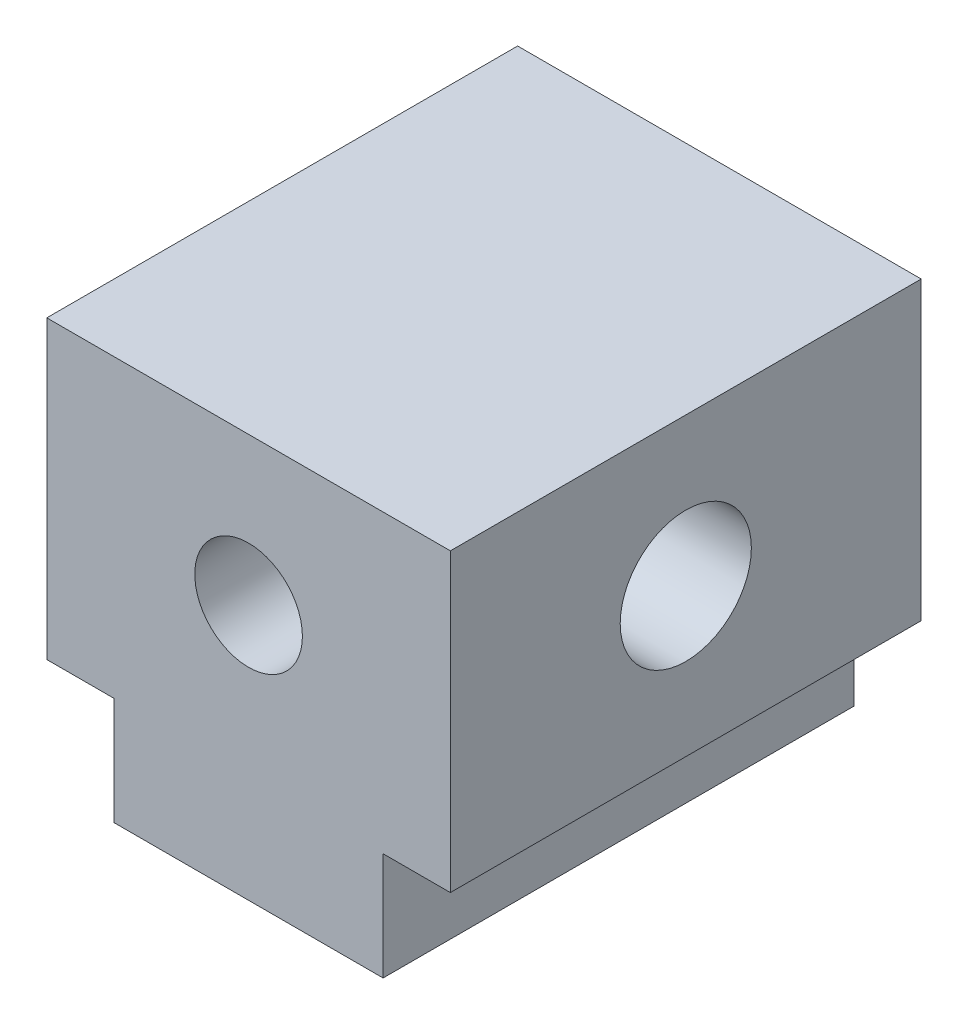
ISO-10303-21;
HEADER;
FILE_DESCRIPTION(('STEP AP214'),'2;1');
FILE_NAME('part.step','',(''),(''),'','','');
FILE_SCHEMA(('AUTOMOTIVE_DESIGN { 1 0 10303 214 1 1 1 1 }'));
ENDSEC;
DATA;
#1=APPLICATION_CONTEXT('core data for automotive mechanical design processes');
#2=APPLICATION_PROTOCOL_DEFINITION('international standard','automotive_design',2000,#1);
#3=PRODUCT_CONTEXT('',#1,'mechanical');
#4=PRODUCT('Part','Part','',(#3));
#5=PRODUCT_RELATED_PRODUCT_CATEGORY('part','',(#4));
#6=PRODUCT_DEFINITION_FORMATION('','',#4);
#7=PRODUCT_DEFINITION_CONTEXT('part definition',#1,'design');
#8=PRODUCT_DEFINITION('design','',#6,#7);
#9=PRODUCT_DEFINITION_SHAPE('','',#8);
#10=(LENGTH_UNIT() NAMED_UNIT(*) SI_UNIT(.MILLI.,.METRE.));
#11=(NAMED_UNIT(*) PLANE_ANGLE_UNIT() SI_UNIT($,.RADIAN.));
#12=(NAMED_UNIT(*) SI_UNIT($,.STERADIAN.) SOLID_ANGLE_UNIT());
#13=UNCERTAINTY_MEASURE_WITH_UNIT(LENGTH_MEASURE(1.E-05),#10,'distance_accuracy_value','');
#14=(GEOMETRIC_REPRESENTATION_CONTEXT(3) GLOBAL_UNCERTAINTY_ASSIGNED_CONTEXT((#13)) GLOBAL_UNIT_ASSIGNED_CONTEXT((#10,
#11,#12)) REPRESENTATION_CONTEXT('',''));
#15=CARTESIAN_POINT('',(0.,0.,0.));
#16=DIRECTION('',(0.,0.,1.));
#17=DIRECTION('',(1.,0.,0.));
#18=AXIS2_PLACEMENT_3D('',#15,#16,#17);
#19=CARTESIAN_POINT('',(0.,3.8,-3.501));
#20=DIRECTION('',(0.,0.,1.));
#21=DIRECTION('',(1.,0.,0.));
#22=AXIS2_PLACEMENT_3D('',#19,#20,#21);
#23=CYLINDRICAL_SURFACE('',#22,0.8);
#24=CARTESIAN_POINT('',(0.8,3.8,-0.975));
#25=CARTESIAN_POINT('',(0.79999675378019,3.83813522650326,-0.974996835684643));
#26=CARTESIAN_POINT('',(0.797250701604247,3.87631607682697,-0.972740254379695));
#27=CARTESIAN_POINT('',(0.786456623715734,3.95143626600888,-0.963913791725579));
#28=CARTESIAN_POINT('',(0.778398753182734,3.98837316548692,-0.957335901424593));
#29=CARTESIAN_POINT('',(0.757575286272899,4.05971588671167,-0.940482912094043));
#30=CARTESIAN_POINT('',(0.744839617977395,4.09413616656669,-0.930231326934823));
#31=CARTESIAN_POINT('',(0.715307168878112,4.16005903466576,-0.906757687563252));
#32=CARTESIAN_POINT('',(0.698509974464046,4.19156132530076,-0.893535330828602));
#33=CARTESIAN_POINT('',(0.654774225304942,4.26212655074264,-0.859707001268203));
#34=CARTESIAN_POINT('',(0.626362344325594,4.29982362032105,-0.838157251538843));
#35=CARTESIAN_POINT('',(0.564214865219415,4.36906643621973,-0.792785443210562));
#36=CARTESIAN_POINT('',(0.530464125561202,4.40059409865207,-0.76895700041883));
#37=CARTESIAN_POINT('',(0.457608635794029,4.45786250220208,-0.720602432408092));
#38=CARTESIAN_POINT('',(0.418420804702678,4.48349277558161,-0.696071386235007));
#39=CARTESIAN_POINT('',(0.335099143615724,4.52796311027631,-0.649399668387679));
#40=CARTESIAN_POINT('',(0.290981291369387,4.54682431794605,-0.62725170656325));
#41=CARTESIAN_POINT('',(0.218161420313733,4.57016320390681,-0.598045361603958));
#42=CARTESIAN_POINT('',(0.191270016242333,4.57731307879045,-0.588645322557748));
#43=CARTESIAN_POINT('',(0.136019304792788,4.58885476415115,-0.573085406868067));
#44=CARTESIAN_POINT('',(0.107663845856726,4.59325344313027,-0.566917467423065));
#45=CARTESIAN_POINT('',(0.0496956827260018,4.5989896304707,-0.558809880083556));
#46=CARTESIAN_POINT('',(0.0200727428057121,4.60029373672876,-0.556916380031102));
#47=CARTESIAN_POINT('',(-0.0390564443748505,4.5995936405355,-0.557920101079986));
#48=CARTESIAN_POINT('',(-0.0685626378581383,4.5975880591109,-0.560819319056451));
#49=CARTESIAN_POINT('',(-0.129767772416907,4.59007590671847,-0.571356918283067));
#50=CARTESIAN_POINT('',(-0.16132814469529,4.58419290501566,-0.579502417660072));
#51=CARTESIAN_POINT('',(-0.222476569919387,4.56909199264604,-0.599397929076108));
#52=CARTESIAN_POINT('',(-0.252058010456078,4.55986350417003,-0.61115935588377));
#53=CARTESIAN_POINT('',(-0.324932725291099,4.53257390802003,-0.643914726395867));
#54=CARTESIAN_POINT('',(-0.36676301032691,4.51245047068432,-0.666417628397463));
#55=CARTESIAN_POINT('',(-0.445772150055578,4.46587699922014,-0.712971156308936));
#56=CARTESIAN_POINT('',(-0.482943091123136,4.43941641781352,-0.737024313094684));
#57=CARTESIAN_POINT('',(-0.553985770683789,4.37909982747328,-0.785381905826078));
#58=CARTESIAN_POINT('',(-0.587661160701332,4.34498624428276,-0.809656590655655));
#59=CARTESIAN_POINT('',(-0.649069029951085,4.27014846792406,-0.855276304492544));
#60=CARTESIAN_POINT('',(-0.676815813384127,4.22944061242037,-0.876628339278555));
#61=CARTESIAN_POINT('',(-0.718561299582658,4.15356749581979,-0.909305542959162));
#62=CARTESIAN_POINT('',(-0.734252194569319,4.11983195257097,-0.921785073334877));
#63=CARTESIAN_POINT('',(-0.761020368817385,4.04951852440013,-0.943245768081007));
#64=CARTESIAN_POINT('',(-0.772100889028747,4.012942657673,-0.952229389677891));
#65=CARTESIAN_POINT('',(-0.789037108575718,3.93755441218489,-0.966012473438505));
#66=CARTESIAN_POINT('',(-0.794858078201296,3.89872894307677,-0.970784118502424));
#67=CARTESIAN_POINT('',(-0.800704248928243,3.82035448297525,-0.975576367136624));
#68=CARTESIAN_POINT('',(-0.800731971727789,3.78080581427516,-0.975599037851699));
#69=CARTESIAN_POINT('',(-0.795299606155112,3.70650389397399,-0.971146107746782));
#70=CARTESIAN_POINT('',(-0.790407437574687,3.67167811322787,-0.967136022318082));
#71=CARTESIAN_POINT('',(-0.776279628166083,3.60352712348421,-0.955624587323457));
#72=CARTESIAN_POINT('',(-0.767043212712076,3.57020218326432,-0.94812261511913));
#73=CARTESIAN_POINT('',(-0.744315275944544,3.50463405077271,-0.929829572303148));
#74=CARTESIAN_POINT('',(-0.730687875297833,3.47246791095862,-0.918933901996815));
#75=CARTESIAN_POINT('',(-0.699870723536614,3.41094148321845,-0.894625555272722));
#76=CARTESIAN_POINT('',(-0.682679920908722,3.38158202725322,-0.881212136010745));
#77=CARTESIAN_POINT('',(-0.636772104130254,3.31327851603956,-0.846046245599281));
#78=CARTESIAN_POINT('',(-0.606357424126155,3.27600061143419,-0.823264968404886));
#79=CARTESIAN_POINT('',(-0.540082393800863,3.20790091131542,-0.775742295350261));
#80=CARTESIAN_POINT('',(-0.504201414092135,3.17710467240532,-0.75099365154501));
#81=CARTESIAN_POINT('',(-0.426850860018546,3.12168720590458,-0.701369130728367));
#82=CARTESIAN_POINT('',(-0.385296293367918,3.09718044238039,-0.676498301479591));
#83=CARTESIAN_POINT('',(-0.296886290088613,3.05553690454922,-0.630357868519232));
#84=CARTESIAN_POINT('',(-0.250060246482033,3.03836159532296,-0.609069800722386));
#85=CARTESIAN_POINT('',(-0.174719889137956,3.01885925598321,-0.583584395880664));
#86=CARTESIAN_POINT('',(-0.148168289177712,3.01336003061554,-0.576083739341004));
#87=CARTESIAN_POINT('',(-0.0939349122873552,3.00506289122422,-0.564580077726652));
#88=CARTESIAN_POINT('',(-0.0662562092012478,3.00225808398754,-0.560568149838496));
#89=CARTESIAN_POINT('',(-0.0102690743506266,2.99957299751458,-0.556730435753923));
#90=CARTESIAN_POINT('',(0.0180422770977283,2.99971180100574,-0.556931964273182));
#91=CARTESIAN_POINT('',(0.0741627798115741,3.00294720986337,-0.561549935443922));
#92=CARTESIAN_POINT('',(0.101971107715643,3.00604828364187,-0.565972745644235));
#93=CARTESIAN_POINT('',(0.163453658863582,3.0161043390223,-0.579845955370775));
#94=CARTESIAN_POINT('',(0.196759994092443,3.02385511662736,-0.590308697731782));
#95=CARTESIAN_POINT('',(0.260980780257925,3.04301950696168,-0.614691957527655));
#96=CARTESIAN_POINT('',(0.291887352225557,3.05444460023147,-0.628623281454652));
#97=CARTESIAN_POINT('',(0.366959447457161,3.08740078165481,-0.666130982109441));
#98=CARTESIAN_POINT('',(0.409562903591044,3.11108804270886,-0.690930049676412));
#99=CARTESIAN_POINT('',(0.489602830672881,3.165469107549,-0.741200898898482));
#100=CARTESIAN_POINT('',(0.527032187382607,3.19617240737921,-0.766673550531718));
#101=CARTESIAN_POINT('',(0.597076400177648,3.2652403701182,-0.816399414187212));
#102=CARTESIAN_POINT('',(0.629574814985298,3.30375121232134,-0.840616203376616));
#103=CARTESIAN_POINT('',(0.687521966500875,3.38781267318771,-0.884852982938632));
#104=CARTESIAN_POINT('',(0.712991961276728,3.43334139977748,-0.904885583059464));
#105=CARTESIAN_POINT('',(0.748196692318942,3.51456613899067,-0.932926479586346));
#106=CARTESIAN_POINT('',(0.760353144907861,3.54860411889297,-0.942724386882504));
#107=CARTESIAN_POINT('',(0.78004825938306,3.61877185233386,-0.958679434124356));
#108=CARTESIAN_POINT('',(0.787598015950142,3.65489634898366,-0.964845320111216));
#109=CARTESIAN_POINT('',(0.795065707262808,3.7094542564849,-0.970954629311222));
#110=CARTESIAN_POINT('',(0.796912007444435,3.72747491621141,-0.97246759980646));
#111=CARTESIAN_POINT('',(0.79938008539513,3.76366023894891,-0.97449116854848));
#112=CARTESIAN_POINT('',(0.800001547132455,3.78182493791125,-0.975001508097193));
#113=CARTESIAN_POINT('',(0.8,3.8,-0.975));
#114=B_SPLINE_CURVE_WITH_KNOTS('',3,(#24,#25,#26,#27,#28,#29,#30,#31,#32,#33,#34,#35,#36,#37,
#38,#39,#40,#41,#42,#43,#44,#45,#46,#47,#48,#49,#50,#51,#52,#53,#54,#55,#56,#57,#58,#59,#60,#61,
#62,#63,#64,#65,#66,#67,#68,#69,#70,#71,#72,#73,#74,#75,#76,#77,#78,#79,#80,#81,#82,#83,#84,#85,
#86,#87,#88,#89,#90,#91,#92,#93,#94,#95,#96,#97,#98,#99,#100,#101,#102,#103,#104,#105,#106,#107,
#108,#109,#110,#111,#112,#113),.UNSPECIFIED.,.T.,.F.,(4,2,2,2,2,2,2,2,2,2,2,2,2,2,2,2,2,2,2,2,2,
2,2,2,2,2,2,2,2,2,2,2,2,2,2,2,2,2,2,2,2,2,2,2,4),(0.,0.11432670953963,0.228865907962485,
0.342684710002764,0.456515107799814,0.61136206472006,0.766656327897404,0.924657898727377,
1.08216149042491,1.17001262710475,1.25764355416348,1.34621613038743,1.4348256194769,
1.5336351336946,1.63275982975433,1.78669715802016,1.94089249577837,2.10137571012462,
2.26146723466342,2.37873959773409,2.49592938213153,2.61388745252117,2.73179417773601,
2.83749264648885,2.94320996956206,3.05257663920771,3.16197562758952,3.32082383116902,
3.48028708708496,3.64247421364954,3.80379804438979,3.88790724118201,3.97180068120542,
4.05623814770604,4.14080318466629,4.24748415772695,4.35450175197632,4.51772806714589,
4.68117662775412,4.84802764319906,5.01436832943688,5.12627402303128,5.2379091301729,
5.29238262637357,5.346870175939),.UNSPECIFIED.);
#115=CARTESIAN_POINT('',(0.8,3.8,-0.975));
#116=VERTEX_POINT('',#115);
#117=EDGE_CURVE('E152',#116,#116,#114,.T.);
#118=ORIENTED_EDGE('',*,*,#117,.T.);
#119=EDGE_LOOP('',(#118));
#120=FACE_BOUND('',#119,.T.);
#121=CARTESIAN_POINT('',(0.,3.8,-3.5));
#122=DIRECTION('',(0.,0.,1.));
#123=DIRECTION('',(1.,0.,0.));
#124=AXIS2_PLACEMENT_3D('',#121,#122,#123);
#125=CIRCLE('',#124,0.8);
#126=CARTESIAN_POINT('',(0.8,3.8,-3.5));
#127=VERTEX_POINT('',#126);
#128=EDGE_CURVE('E219',#127,#127,#125,.F.);
#129=ORIENTED_EDGE('',*,*,#128,.T.);
#130=EDGE_LOOP('',(#129));
#131=FACE_BOUND('',#130,.T.);
#132=ADVANCED_FACE('F34',(#120,#131),#23,.F.);
#133=CARTESIAN_POINT('',(-2.,6.,3.5));
#134=DIRECTION('',(1.,0.,0.));
#135=DIRECTION('',(0.,0.,-1.));
#136=AXIS2_PLACEMENT_3D('',#133,#134,#135);
#137=PLANE('',#136);
#138=DIRECTION('',(0.,0.,1.));
#139=VECTOR('',#138,1.);
#140=CARTESIAN_POINT('',(-2.,1.6,-8.01220566907139));
#141=LINE('',#140,#139);
#142=CARTESIAN_POINT('',(-2.,1.6,-3.5));
#143=VERTEX_POINT('',#142);
#144=CARTESIAN_POINT('',(-2.,1.6,3.5));
#145=VERTEX_POINT('',#144);
#146=EDGE_CURVE('E51',#143,#145,#141,.T.);
#147=ORIENTED_EDGE('',*,*,#146,.F.);
#148=DIRECTION('',(0.,-1.,0.));
#149=VECTOR('',#148,1.);
#150=CARTESIAN_POINT('',(-2.,6.,-3.5));
#151=LINE('',#150,#149);
#152=CARTESIAN_POINT('',(-2.,0.,-3.5));
#153=VERTEX_POINT('',#152);
#154=EDGE_CURVE('E43',#143,#153,#151,.T.);
#155=ORIENTED_EDGE('',*,*,#154,.T.);
#156=DIRECTION('',(0.,0.,1.));
#157=VECTOR('',#156,1.);
#158=CARTESIAN_POINT('',(-2.,0.,3.5));
#159=LINE('',#158,#157);
#160=CARTESIAN_POINT('',(-2.,0.,3.5));
#161=VERTEX_POINT('',#160);
#162=EDGE_CURVE('E185',#153,#161,#159,.T.);
#163=ORIENTED_EDGE('',*,*,#162,.T.);
#164=DIRECTION('',(0.,-1.,0.));
#165=VECTOR('',#164,1.);
#166=CARTESIAN_POINT('',(-2.,6.,3.5));
#167=LINE('',#166,#165);
#168=EDGE_CURVE('E178',#145,#161,#167,.T.);
#169=ORIENTED_EDGE('',*,*,#168,.F.);
#170=EDGE_LOOP('',(#147,#155,#163,#169));
#171=FACE_BOUND('',#170,.T.);
#172=ADVANCED_FACE('F186',(#171),#137,.F.);
#173=CARTESIAN_POINT('',(2.,6.,3.5));
#174=DIRECTION('',(-1.,0.,0.));
#175=DIRECTION('',(0.,0.,1.));
#176=AXIS2_PLACEMENT_3D('',#173,#174,#175);
#177=PLANE('',#176);
#178=DIRECTION('',(0.,-1.,0.));
#179=VECTOR('',#178,1.);
#180=CARTESIAN_POINT('',(2.,6.,-3.5));
#181=LINE('',#180,#179);
#182=CARTESIAN_POINT('',(2.,1.6,-3.5));
#183=VERTEX_POINT('',#182);
#184=CARTESIAN_POINT('',(2.,0.,-3.5));
#185=VERTEX_POINT('',#184);
#186=EDGE_CURVE('E12',#183,#185,#181,.T.);
#187=ORIENTED_EDGE('',*,*,#186,.F.);
#188=DIRECTION('',(0.,0.,1.));
#189=VECTOR('',#188,1.);
#190=CARTESIAN_POINT('',(2.,1.6,-8.01220566907139));
#191=LINE('',#190,#189);
#192=CARTESIAN_POINT('',(2.,1.6,3.5));
#193=VERTEX_POINT('',#192);
#194=EDGE_CURVE('E206',#183,#193,#191,.T.);
#195=ORIENTED_EDGE('',*,*,#194,.T.);
#196=DIRECTION('',(0.,-1.,0.));
#197=VECTOR('',#196,1.);
#198=CARTESIAN_POINT('',(2.,6.,3.5));
#199=LINE('',#198,#197);
#200=CARTESIAN_POINT('',(2.,0.,3.5));
#201=VERTEX_POINT('',#200);
#202=EDGE_CURVE('E138',#193,#201,#199,.T.);
#203=ORIENTED_EDGE('',*,*,#202,.T.);
#204=DIRECTION('',(0.,0.,-1.));
#205=VECTOR('',#204,1.);
#206=CARTESIAN_POINT('',(2.,0.,3.5));
#207=LINE('',#206,#205);
#208=EDGE_CURVE('E193',#201,#185,#207,.T.);
#209=ORIENTED_EDGE('',*,*,#208,.T.);
#210=EDGE_LOOP('',(#187,#195,#203,#209));
#211=FACE_BOUND('',#210,.T.);
#212=ADVANCED_FACE('F36',(#211),#177,.F.);
#213=CARTESIAN_POINT('',(-2.,6.,-3.5));
#214=DIRECTION('',(0.,0.,1.));
#215=DIRECTION('',(1.,0.,0.));
#216=AXIS2_PLACEMENT_3D('',#213,#214,#215);
#217=PLANE('',#216);
#218=ORIENTED_EDGE('',*,*,#128,.F.);
#219=EDGE_LOOP('',(#218));
#220=FACE_BOUND('',#219,.T.);
#221=DIRECTION('',(-1.,0.,0.));
#222=VECTOR('',#221,1.);
#223=CARTESIAN_POINT('',(-2.,0.,-3.5));
#224=LINE('',#223,#222);
#225=EDGE_CURVE('E189',#185,#153,#224,.T.);
#226=ORIENTED_EDGE('',*,*,#225,.T.);
#227=ORIENTED_EDGE('',*,*,#154,.F.);
#228=DIRECTION('',(-1.,0.,0.));
#229=VECTOR('',#228,1.);
#230=CARTESIAN_POINT('',(-2.,1.6,-3.5));
#231=LINE('',#230,#229);
#232=CARTESIAN_POINT('',(-3.,1.6,-3.5));
#233=VERTEX_POINT('',#232);
#234=EDGE_CURVE('E169',#143,#233,#231,.T.);
#235=ORIENTED_EDGE('',*,*,#234,.T.);
#236=DIRECTION('',(0.,1.,0.));
#237=VECTOR('',#236,1.);
#238=CARTESIAN_POINT('',(-3.,6.,-3.5));
#239=LINE('',#238,#237);
#240=CARTESIAN_POINT('',(-3.,6.,-3.5));
#241=VERTEX_POINT('',#240);
#242=EDGE_CURVE('E160',#233,#241,#239,.T.);
#243=ORIENTED_EDGE('',*,*,#242,.T.);
#244=DIRECTION('',(-1.,0.,0.));
#245=VECTOR('',#244,1.);
#246=CARTESIAN_POINT('',(-2.,6.,-3.5));
#247=LINE('',#246,#245);
#248=CARTESIAN_POINT('',(3.,6.,-3.5));
#249=VERTEX_POINT('',#248);
#250=EDGE_CURVE('E139',#249,#241,#247,.T.);
#251=ORIENTED_EDGE('',*,*,#250,.F.);
#252=DIRECTION('',(0.,-1.,0.));
#253=VECTOR('',#252,1.);
#254=CARTESIAN_POINT('',(3.,6.,-3.5));
#255=LINE('',#254,#253);
#256=CARTESIAN_POINT('',(3.,1.6,-3.5));
#257=VERTEX_POINT('',#256);
#258=EDGE_CURVE('E259',#249,#257,#255,.T.);
#259=ORIENTED_EDGE('',*,*,#258,.T.);
#260=DIRECTION('',(-1.,0.,0.));
#261=VECTOR('',#260,1.);
#262=CARTESIAN_POINT('',(2.,1.6,-3.5));
#263=LINE('',#262,#261);
#264=EDGE_CURVE('E210',#257,#183,#263,.T.);
#265=ORIENTED_EDGE('',*,*,#264,.T.);
#266=ORIENTED_EDGE('',*,*,#186,.T.);
#267=EDGE_LOOP('',(#226,#227,#235,#243,#251,#259,#265,#266));
#268=FACE_BOUND('',#267,.T.);
#269=ADVANCED_FACE('F174',(#220,#268),#217,.F.);
#270=CARTESIAN_POINT('',(-2.,6.,3.5));
#271=DIRECTION('',(0.,0.,-1.));
#272=DIRECTION('',(-1.,0.,0.));
#273=AXIS2_PLACEMENT_3D('',#270,#271,#272);
#274=PLANE('',#273);
#275=CARTESIAN_POINT('',(0.,3.8,3.5));
#276=DIRECTION('',(0.,0.,1.));
#277=DIRECTION('',(1.,0.,0.));
#278=AXIS2_PLACEMENT_3D('',#275,#276,#277);
#279=CIRCLE('',#278,0.8);
#280=CARTESIAN_POINT('',(0.8,3.8,3.5));
#281=VERTEX_POINT('',#280);
#282=EDGE_CURVE('E216',#281,#281,#279,.T.);
#283=ORIENTED_EDGE('',*,*,#282,.F.);
#284=EDGE_LOOP('',(#283));
#285=FACE_BOUND('',#284,.T.);
#286=DIRECTION('',(1.,0.,0.));
#287=VECTOR('',#286,1.);
#288=CARTESIAN_POINT('',(-2.,0.,3.5));
#289=LINE('',#288,#287);
#290=EDGE_CURVE('E182',#161,#201,#289,.T.);
#291=ORIENTED_EDGE('',*,*,#290,.T.);
#292=ORIENTED_EDGE('',*,*,#202,.F.);
#293=DIRECTION('',(1.,0.,0.));
#294=VECTOR('',#293,1.);
#295=CARTESIAN_POINT('',(2.,1.6,3.5));
#296=LINE('',#295,#294);
#297=CARTESIAN_POINT('',(3.,1.6,3.5));
#298=VERTEX_POINT('',#297);
#299=EDGE_CURVE('E59',#193,#298,#296,.T.);
#300=ORIENTED_EDGE('',*,*,#299,.T.);
#301=DIRECTION('',(0.,1.,0.));
#302=VECTOR('',#301,1.);
#303=CARTESIAN_POINT('',(3.,6.,3.5));
#304=LINE('',#303,#302);
#305=CARTESIAN_POINT('',(3.,6.,3.5));
#306=VERTEX_POINT('',#305);
#307=EDGE_CURVE('E134',#298,#306,#304,.T.);
#308=ORIENTED_EDGE('',*,*,#307,.T.);
#309=DIRECTION('',(1.,0.,0.));
#310=VECTOR('',#309,1.);
#311=CARTESIAN_POINT('',(-2.,6.,3.5));
#312=LINE('',#311,#310);
#313=CARTESIAN_POINT('',(-3.,6.,3.5));
#314=VERTEX_POINT('',#313);
#315=EDGE_CURVE('E125',#314,#306,#312,.T.);
#316=ORIENTED_EDGE('',*,*,#315,.F.);
#317=DIRECTION('',(0.,-1.,0.));
#318=VECTOR('',#317,1.);
#319=CARTESIAN_POINT('',(-3.,6.,3.5));
#320=LINE('',#319,#318);
#321=CARTESIAN_POINT('',(-3.,1.6,3.5));
#322=VERTEX_POINT('',#321);
#323=EDGE_CURVE('E131',#314,#322,#320,.T.);
#324=ORIENTED_EDGE('',*,*,#323,.T.);
#325=DIRECTION('',(1.,0.,0.));
#326=VECTOR('',#325,1.);
#327=CARTESIAN_POINT('',(-2.,1.6,3.5));
#328=LINE('',#327,#326);
#329=EDGE_CURVE('E148',#322,#145,#328,.T.);
#330=ORIENTED_EDGE('',*,*,#329,.T.);
#331=ORIENTED_EDGE('',*,*,#168,.T.);
#332=EDGE_LOOP('',(#291,#292,#300,#308,#316,#324,#330,#331));
#333=FACE_BOUND('',#332,.T.);
#334=ADVANCED_FACE('F128',(#285,#333),#274,.F.);
#335=CARTESIAN_POINT('',(0.,6.,0.));
#336=DIRECTION('',(0.,-1.,0.));
#337=DIRECTION('',(0.,0.,-1.));
#338=AXIS2_PLACEMENT_3D('',#335,#336,#337);
#339=PLANE('',#338);
#340=ORIENTED_EDGE('',*,*,#315,.T.);
#341=DIRECTION('',(0.,0.,1.));
#342=VECTOR('',#341,1.);
#343=CARTESIAN_POINT('',(3.,6.,-8.01220566907139));
#344=LINE('',#343,#342);
#345=EDGE_CURVE('E260',#249,#306,#344,.T.);
#346=ORIENTED_EDGE('',*,*,#345,.F.);
#347=ORIENTED_EDGE('',*,*,#250,.T.);
#348=DIRECTION('',(0.,0.,1.));
#349=VECTOR('',#348,1.);
#350=CARTESIAN_POINT('',(-3.,6.,-8.01220566907139));
#351=LINE('',#350,#349);
#352=EDGE_CURVE('E142',#241,#314,#351,.T.);
#353=ORIENTED_EDGE('',*,*,#352,.T.);
#354=EDGE_LOOP('',(#340,#346,#347,#353));
#355=FACE_BOUND('',#354,.T.);
#356=ADVANCED_FACE('F143',(#355),#339,.F.);
#357=CARTESIAN_POINT('',(0.,0.,0.));
#358=DIRECTION('',(0.,-1.,0.));
#359=DIRECTION('',(0.,0.,-1.));
#360=AXIS2_PLACEMENT_3D('',#357,#358,#359);
#361=PLANE('',#360);
#362=DIRECTION('',(0.,0.,1.));
#363=VECTOR('',#362,1.);
#364=CARTESIAN_POINT('',(0.75,0.,-2.35));
#365=LINE('',#364,#363);
#366=CARTESIAN_POINT('',(0.75,0.,-2.35));
#367=VERTEX_POINT('',#366);
#368=CARTESIAN_POINT('',(0.75,0.,2.35));
#369=VERTEX_POINT('',#368);
#370=EDGE_CURVE('E222',#367,#369,#365,.T.);
#371=ORIENTED_EDGE('',*,*,#370,.F.);
#372=DIRECTION('',(1.,0.,0.));
#373=VECTOR('',#372,1.);
#374=CARTESIAN_POINT('',(-0.75,0.,-2.35));
#375=LINE('',#374,#373);
#376=CARTESIAN_POINT('',(-0.75,0.,-2.35));
#377=VERTEX_POINT('',#376);
#378=EDGE_CURVE('E227',#377,#367,#375,.T.);
#379=ORIENTED_EDGE('',*,*,#378,.F.);
#380=DIRECTION('',(0.,0.,-1.));
#381=VECTOR('',#380,1.);
#382=CARTESIAN_POINT('',(-0.75,0.,-2.35));
#383=LINE('',#382,#381);
#384=CARTESIAN_POINT('',(-0.75,0.,2.35));
#385=VERTEX_POINT('',#384);
#386=EDGE_CURVE('E241',#385,#377,#383,.T.);
#387=ORIENTED_EDGE('',*,*,#386,.F.);
#388=DIRECTION('',(-1.,0.,0.));
#389=VECTOR('',#388,1.);
#390=CARTESIAN_POINT('',(-0.75,0.,2.35));
#391=LINE('',#390,#389);
#392=EDGE_CURVE('E238',#369,#385,#391,.T.);
#393=ORIENTED_EDGE('',*,*,#392,.F.);
#394=EDGE_LOOP('',(#371,#379,#387,#393));
#395=FACE_BOUND('',#394,.T.);
#396=ORIENTED_EDGE('',*,*,#208,.F.);
#397=ORIENTED_EDGE('',*,*,#290,.F.);
#398=ORIENTED_EDGE('',*,*,#162,.F.);
#399=ORIENTED_EDGE('',*,*,#225,.F.);
#400=EDGE_LOOP('',(#396,#397,#398,#399));
#401=FACE_BOUND('',#400,.T.);
#402=ADVANCED_FACE('F191',(#395,#401),#361,.T.);
#403=CARTESIAN_POINT('',(0.75,1.5,-2.35));
#404=DIRECTION('',(1.,0.,0.));
#405=DIRECTION('',(0.,0.,-1.));
#406=AXIS2_PLACEMENT_3D('',#403,#404,#405);
#407=PLANE('',#406);
#408=ORIENTED_EDGE('',*,*,#370,.T.);
#409=DIRECTION('',(0.,-1.,0.));
#410=VECTOR('',#409,1.);
#411=CARTESIAN_POINT('',(0.75,1.5,2.35));
#412=LINE('',#411,#410);
#413=CARTESIAN_POINT('',(0.75,1.5,2.35));
#414=VERTEX_POINT('',#413);
#415=EDGE_CURVE('E236',#414,#369,#412,.T.);
#416=ORIENTED_EDGE('',*,*,#415,.F.);
#417=DIRECTION('',(0.,0.,1.));
#418=VECTOR('',#417,1.);
#419=CARTESIAN_POINT('',(0.75,1.5,-2.35));
#420=LINE('',#419,#418);
#421=CARTESIAN_POINT('',(0.75,1.5,-2.35));
#422=VERTEX_POINT('',#421);
#423=EDGE_CURVE('E223',#422,#414,#420,.T.);
#424=ORIENTED_EDGE('',*,*,#423,.F.);
#425=DIRECTION('',(0.,-1.,0.));
#426=VECTOR('',#425,1.);
#427=CARTESIAN_POINT('',(0.75,1.5,-2.35));
#428=LINE('',#427,#426);
#429=EDGE_CURVE('E246',#422,#367,#428,.T.);
#430=ORIENTED_EDGE('',*,*,#429,.T.);
#431=EDGE_LOOP('',(#408,#416,#424,#430));
#432=FACE_BOUND('',#431,.T.);
#433=ADVANCED_FACE('F333',(#432),#407,.F.);
#434=CARTESIAN_POINT('',(-0.75,1.5,-2.35));
#435=DIRECTION('',(0.,0.,-1.));
#436=DIRECTION('',(-1.,0.,0.));
#437=AXIS2_PLACEMENT_3D('',#434,#435,#436);
#438=PLANE('',#437);
#439=ORIENTED_EDGE('',*,*,#378,.T.);
#440=ORIENTED_EDGE('',*,*,#429,.F.);
#441=DIRECTION('',(1.,0.,0.));
#442=VECTOR('',#441,1.);
#443=CARTESIAN_POINT('',(-0.75,1.5,-2.35));
#444=LINE('',#443,#442);
#445=CARTESIAN_POINT('',(-0.75,1.5,-2.35));
#446=VERTEX_POINT('',#445);
#447=EDGE_CURVE('E233',#446,#422,#444,.T.);
#448=ORIENTED_EDGE('',*,*,#447,.F.);
#449=DIRECTION('',(0.,-1.,0.));
#450=VECTOR('',#449,1.);
#451=CARTESIAN_POINT('',(-0.75,1.5,-2.35));
#452=LINE('',#451,#450);
#453=EDGE_CURVE('E248',#446,#377,#452,.T.);
#454=ORIENTED_EDGE('',*,*,#453,.T.);
#455=EDGE_LOOP('',(#439,#440,#448,#454));
#456=FACE_BOUND('',#455,.T.);
#457=ADVANCED_FACE('F338',(#456),#438,.F.);
#458=CARTESIAN_POINT('',(-0.75,1.5,-2.35));
#459=DIRECTION('',(-1.,0.,0.));
#460=DIRECTION('',(0.,0.,1.));
#461=AXIS2_PLACEMENT_3D('',#458,#459,#460);
#462=PLANE('',#461);
#463=ORIENTED_EDGE('',*,*,#386,.T.);
#464=ORIENTED_EDGE('',*,*,#453,.F.);
#465=DIRECTION('',(0.,0.,-1.));
#466=VECTOR('',#465,1.);
#467=CARTESIAN_POINT('',(-0.75,1.5,-2.35));
#468=LINE('',#467,#466);
#469=CARTESIAN_POINT('',(-0.75,1.5,2.35));
#470=VERTEX_POINT('',#469);
#471=EDGE_CURVE('E230',#470,#446,#468,.T.);
#472=ORIENTED_EDGE('',*,*,#471,.F.);
#473=DIRECTION('',(0.,-1.,0.));
#474=VECTOR('',#473,1.);
#475=CARTESIAN_POINT('',(-0.75,1.5,2.35));
#476=LINE('',#475,#474);
#477=EDGE_CURVE('E250',#470,#385,#476,.T.);
#478=ORIENTED_EDGE('',*,*,#477,.T.);
#479=EDGE_LOOP('',(#463,#464,#472,#478));
#480=FACE_BOUND('',#479,.T.);
#481=ADVANCED_FACE('F343',(#480),#462,.F.);
#482=CARTESIAN_POINT('',(-0.75,1.5,2.35));
#483=DIRECTION('',(0.,0.,1.));
#484=DIRECTION('',(1.,0.,0.));
#485=AXIS2_PLACEMENT_3D('',#482,#483,#484);
#486=PLANE('',#485);
#487=ORIENTED_EDGE('',*,*,#392,.T.);
#488=ORIENTED_EDGE('',*,*,#477,.F.);
#489=DIRECTION('',(-1.,0.,0.));
#490=VECTOR('',#489,1.);
#491=CARTESIAN_POINT('',(-0.75,1.5,2.35));
#492=LINE('',#491,#490);
#493=EDGE_CURVE('E226',#414,#470,#492,.T.);
#494=ORIENTED_EDGE('',*,*,#493,.F.);
#495=ORIENTED_EDGE('',*,*,#415,.T.);
#496=EDGE_LOOP('',(#487,#488,#494,#495));
#497=FACE_BOUND('',#496,.T.);
#498=ADVANCED_FACE('F340',(#497),#486,.F.);
#499=CARTESIAN_POINT('',(0.,1.5,0.));
#500=DIRECTION('',(0.,1.,0.));
#501=DIRECTION('',(0.,0.,1.));
#502=AXIS2_PLACEMENT_3D('',#499,#500,#501);
#503=PLANE('',#502);
#504=ORIENTED_EDGE('',*,*,#423,.T.);
#505=ORIENTED_EDGE('',*,*,#493,.T.);
#506=ORIENTED_EDGE('',*,*,#471,.T.);
#507=ORIENTED_EDGE('',*,*,#447,.T.);
#508=EDGE_LOOP('',(#504,#505,#506,#507));
#509=FACE_BOUND('',#508,.T.);
#510=ADVANCED_FACE('F274',(#509),#503,.F.);
#511=CARTESIAN_POINT('',(0.8,3.8,0.975));
#512=CARTESIAN_POINT('',(0.79999675378019,3.76186477349674,0.974996835684644));
#513=CARTESIAN_POINT('',(0.797250701604247,3.72368392317304,0.972740254379695));
#514=CARTESIAN_POINT('',(0.786456623715734,3.64856373399112,0.963913791725579));
#515=CARTESIAN_POINT('',(0.778398753182735,3.61162683451309,0.957335901424593));
#516=CARTESIAN_POINT('',(0.757575286272899,3.54028411328833,0.940482912094044));
#517=CARTESIAN_POINT('',(0.744839617977395,3.50586383343331,0.930231326934824));
#518=CARTESIAN_POINT('',(0.715307168878113,3.43994096533424,0.906757687563253));
#519=CARTESIAN_POINT('',(0.698509974464047,3.40843867469925,0.893535330828603));
#520=CARTESIAN_POINT('',(0.654774225304943,3.33787344925736,0.859707001268204));
#521=CARTESIAN_POINT('',(0.626362344325595,3.30017637967895,0.838157251538844));
#522=CARTESIAN_POINT('',(0.564214865219416,3.23093356378027,0.792785443210563));
#523=CARTESIAN_POINT('',(0.530464125561203,3.19940590134793,0.768957000418832));
#524=CARTESIAN_POINT('',(0.457608635794031,3.14213749779793,0.720602432408093));
#525=CARTESIAN_POINT('',(0.41842080470268,3.11650722441839,0.696071386235009));
#526=CARTESIAN_POINT('',(0.335099143615726,3.07203688972369,0.649399668387681));
#527=CARTESIAN_POINT('',(0.29098129136939,3.05317568205395,0.627251706563252));
#528=CARTESIAN_POINT('',(0.218161420313736,3.02983679609319,0.598045361603959));
#529=CARTESIAN_POINT('',(0.191270016242336,3.02268692120955,0.588645322557749));
#530=CARTESIAN_POINT('',(0.13601930479279,3.01114523584885,0.573085406868069));
#531=CARTESIAN_POINT('',(0.107663845856729,3.00674655686973,0.566917467423066));
#532=CARTESIAN_POINT('',(0.0496956827260042,3.0010103695293,0.558809880083557));
#533=CARTESIAN_POINT('',(0.0200727428057144,2.99970626327124,0.556916380031102));
#534=CARTESIAN_POINT('',(-0.0390564443748484,3.0004063594645,0.557920101079986));
#535=CARTESIAN_POINT('',(-0.0685626378581363,3.0024119408891,0.560819319056451));
#536=CARTESIAN_POINT('',(-0.129767772416905,3.00992409328153,0.571356918283067));
#537=CARTESIAN_POINT('',(-0.161328144695288,3.01580709498434,0.579502417660072));
#538=CARTESIAN_POINT('',(-0.222476569919385,3.03090800735396,0.599397929076108));
#539=CARTESIAN_POINT('',(-0.252058010456076,3.04013649582997,0.61115935588377));
#540=CARTESIAN_POINT('',(-0.324932725291097,3.06742609197997,0.643914726395866));
#541=CARTESIAN_POINT('',(-0.366763010326907,3.08754952931568,0.666417628397462));
#542=CARTESIAN_POINT('',(-0.445772150055574,3.13412300077986,0.712971156308934));
#543=CARTESIAN_POINT('',(-0.482943091123133,3.16058358218647,0.737024313094682));
#544=CARTESIAN_POINT('',(-0.553985770683786,3.22090017252672,0.785381905826076));
#545=CARTESIAN_POINT('',(-0.587661160701329,3.25501375571724,0.809656590655653));
#546=CARTESIAN_POINT('',(-0.649069029951082,3.32985153207594,0.855276304492542));
#547=CARTESIAN_POINT('',(-0.676815813384124,3.37055938757962,0.876628339278553));
#548=CARTESIAN_POINT('',(-0.718561299582656,3.4464325041802,0.90930554295916));
#549=CARTESIAN_POINT('',(-0.734252194569317,3.48016804742902,0.921785073334876));
#550=CARTESIAN_POINT('',(-0.761020368817383,3.55048147559986,0.943245768081007));
#551=CARTESIAN_POINT('',(-0.772100889028746,3.587057342327,0.95222938967789));
#552=CARTESIAN_POINT('',(-0.789037108575717,3.6624455878151,0.966012473438505));
#553=CARTESIAN_POINT('',(-0.794858078201295,3.70127105692323,0.970784118502424));
#554=CARTESIAN_POINT('',(-0.800704248928243,3.77964551702475,0.975576367136624));
#555=CARTESIAN_POINT('',(-0.800731971727789,3.81919418572484,0.9755990378517));
#556=CARTESIAN_POINT('',(-0.795299606155113,3.89349610602601,0.971146107746783));
#557=CARTESIAN_POINT('',(-0.790407437574688,3.92832188677213,0.967136022318082));
#558=CARTESIAN_POINT('',(-0.776279628166084,3.99647287651579,0.955624587323458));
#559=CARTESIAN_POINT('',(-0.767043212712077,4.02979781673567,0.948122615119131));
#560=CARTESIAN_POINT('',(-0.744315275944546,4.09536594922728,0.929829572303149));
#561=CARTESIAN_POINT('',(-0.730687875297834,4.12753208904138,0.918933901996817));
#562=CARTESIAN_POINT('',(-0.699870723536616,4.18905851678155,0.894625555272724));
#563=CARTESIAN_POINT('',(-0.682679920908724,4.21841797274678,0.881212136010747));
#564=CARTESIAN_POINT('',(-0.636772104130256,4.28672148396043,0.846046245599283));
#565=CARTESIAN_POINT('',(-0.606357424126158,4.32399938856581,0.823264968404888));
#566=CARTESIAN_POINT('',(-0.540082393800866,4.39209908868458,0.775742295350264));
#567=CARTESIAN_POINT('',(-0.504201414092139,4.42289532759468,0.750993651545013));
#568=CARTESIAN_POINT('',(-0.426850860018551,4.47831279409541,0.70136913072837));
#569=CARTESIAN_POINT('',(-0.385296293367923,4.50281955761961,0.676498301479595));
#570=CARTESIAN_POINT('',(-0.296886290088619,4.54446309545078,0.630357868519235));
#571=CARTESIAN_POINT('',(-0.25006024648204,4.56163840467704,0.609069800722389));
#572=CARTESIAN_POINT('',(-0.174719889137962,4.58114074401678,0.583584395880666));
#573=CARTESIAN_POINT('',(-0.148168289177719,4.58663996938446,0.576083739341007));
#574=CARTESIAN_POINT('',(-0.0939349122873615,4.59493710877578,0.564580077726653));
#575=CARTESIAN_POINT('',(-0.0662562092012542,4.59774191601246,0.560568149838498));
#576=CARTESIAN_POINT('',(-0.0102690743506328,4.60042700248542,0.556730435753924));
#577=CARTESIAN_POINT('',(0.0180422770977223,4.60028819899426,0.556931964273182));
#578=CARTESIAN_POINT('',(0.0741627798115685,4.59705279013663,0.561549935443922));
#579=CARTESIAN_POINT('',(0.101971107715638,4.59395171635813,0.565972745644235));
#580=CARTESIAN_POINT('',(0.163453658863576,4.5838956609777,0.579845955370774));
#581=CARTESIAN_POINT('',(0.196759994092437,4.57614488337264,0.590308697731781));
#582=CARTESIAN_POINT('',(0.260980780257918,4.55698049303832,0.614691957527653));
#583=CARTESIAN_POINT('',(0.29188735222555,4.54555539976853,0.628623281454649));
#584=CARTESIAN_POINT('',(0.366959447457154,4.51259921834519,0.666130982109438));
#585=CARTESIAN_POINT('',(0.409562903591037,4.48891195729115,0.690930049676408));
#586=CARTESIAN_POINT('',(0.489602830672875,4.434530892451,0.741200898898478));
#587=CARTESIAN_POINT('',(0.527032187382601,4.40382759262079,0.766673550531714));
#588=CARTESIAN_POINT('',(0.597076400177641,4.33475962988181,0.816399414187207));
#589=CARTESIAN_POINT('',(0.629574814985291,4.29624878767866,0.840616203376611));
#590=CARTESIAN_POINT('',(0.687521966500869,4.2121873268123,0.884852982938628));
#591=CARTESIAN_POINT('',(0.712991961276723,4.16665860022253,0.904885583059461));
#592=CARTESIAN_POINT('',(0.748196692318938,4.08543386100934,0.932926479586343));
#593=CARTESIAN_POINT('',(0.760353144907857,4.05139588110705,0.942724386882501));
#594=CARTESIAN_POINT('',(0.780048259383057,3.98122814766615,0.958679434124354));
#595=CARTESIAN_POINT('',(0.78759801595014,3.94510365101635,0.964845320111215));
#596=CARTESIAN_POINT('',(0.795065707262807,3.89054574351511,0.970954629311221));
#597=CARTESIAN_POINT('',(0.796912007444434,3.8725250837886,0.97246759980646));
#598=CARTESIAN_POINT('',(0.79938008539513,3.8363397610511,0.974491168548481));
#599=CARTESIAN_POINT('',(0.800001547132455,3.81817506208875,0.975001508097194));
#600=CARTESIAN_POINT('',(0.8,3.8,0.975));
#601=B_SPLINE_CURVE_WITH_KNOTS('',3,(#511,#512,#513,#514,#515,#516,#517,#518,#519,#520,#521,
#522,#523,#524,#525,#526,#527,#528,#529,#530,#531,#532,#533,#534,#535,#536,#537,#538,#539,#540,
#541,#542,#543,#544,#545,#546,#547,#548,#549,#550,#551,#552,#553,#554,#555,#556,#557,#558,#559,
#560,#561,#562,#563,#564,#565,#566,#567,#568,#569,#570,#571,#572,#573,#574,#575,#576,#577,#578,
#579,#580,#581,#582,#583,#584,#585,#586,#587,#588,#589,#590,#591,#592,#593,#594,#595,#596,#597,
#598,#599,#600),.UNSPECIFIED.,.T.,.F.,(4,2,2,2,2,2,2,2,2,2,2,2,2,2,2,2,2,2,2,2,2,2,2,2,2,2,2,2,
2,2,2,2,2,2,2,2,2,2,2,2,2,2,2,2,4),(0.,0.114326709539629,0.228865907962485,0.342684710002763,
0.456515107799812,0.611362064720059,0.766656327897402,0.924657898727374,1.08216149042491,
1.17001262710475,1.25764355416348,1.34621613038743,1.4348256194769,1.53363513369459,
1.63275982975433,1.78669715802016,1.94089249577836,2.10137571012462,2.26146723466342,
2.37873959773409,2.49592938213152,2.61388745252116,2.731794177736,2.83749264648885,
2.94320996956206,3.0525766392077,3.16197562758951,3.32082383116901,3.48028708708496,
3.64247421364953,3.80379804438978,3.887907241182,3.97180068120541,4.05623814770604,
4.14080318466628,4.24748415772694,4.35450175197631,4.51772806714588,4.68117662775411,
4.84802764319904,5.01436832943687,5.12627402303127,5.23790913017289,5.29238262637357,
5.34687017593899),.UNSPECIFIED.);
#602=CARTESIAN_POINT('',(0.8,3.8,0.975));
#603=VERTEX_POINT('',#602);
#604=EDGE_CURVE('E156',#603,#603,#601,.T.);
#605=ORIENTED_EDGE('',*,*,#604,.T.);
#606=EDGE_LOOP('',(#605));
#607=FACE_BOUND('',#606,.T.);
#608=ORIENTED_EDGE('',*,*,#282,.T.);
#609=EDGE_LOOP('',(#608));
#610=FACE_BOUND('',#609,.T.);
#611=ADVANCED_FACE('F266',(#607,#610),#23,.F.);
#612=CARTESIAN_POINT('',(3.,6.,-8.01220566907139));
#613=DIRECTION('',(1.,0.,0.));
#614=DIRECTION('',(0.,0.,-1.));
#615=AXIS2_PLACEMENT_3D('',#612,#613,#614);
#616=PLANE('',#615);
#617=CARTESIAN_POINT('',(3.,3.8,0.));
#618=DIRECTION('',(1.,0.,0.));
#619=DIRECTION('',(0.,0.,-1.));
#620=AXIS2_PLACEMENT_3D('',#617,#618,#619);
#621=CIRCLE('',#620,0.975);
#622=CARTESIAN_POINT('',(3.,3.8,-0.975));
#623=VERTEX_POINT('',#622);
#624=EDGE_CURVE('E312',#623,#623,#621,.T.);
#625=ORIENTED_EDGE('',*,*,#624,.F.);
#626=EDGE_LOOP('',(#625));
#627=FACE_BOUND('',#626,.T.);
#628=ORIENTED_EDGE('',*,*,#258,.F.);
#629=ORIENTED_EDGE('',*,*,#345,.T.);
#630=ORIENTED_EDGE('',*,*,#307,.F.);
#631=DIRECTION('',(0.,0.,1.));
#632=VECTOR('',#631,1.);
#633=CARTESIAN_POINT('',(3.,1.6,-8.01220566907139));
#634=LINE('',#633,#632);
#635=EDGE_CURVE('E209',#257,#298,#634,.T.);
#636=ORIENTED_EDGE('',*,*,#635,.F.);
#637=EDGE_LOOP('',(#628,#629,#630,#636));
#638=FACE_BOUND('',#637,.T.);
#639=ADVANCED_FACE('F264',(#627,#638),#616,.T.);
#640=CARTESIAN_POINT('',(2.,1.6,-8.01220566907139));
#641=DIRECTION('',(0.,-1.,0.));
#642=DIRECTION('',(1.,0.,0.));
#643=AXIS2_PLACEMENT_3D('',#640,#641,#642);
#644=PLANE('',#643);
#645=ORIENTED_EDGE('',*,*,#264,.F.);
#646=ORIENTED_EDGE('',*,*,#635,.T.);
#647=ORIENTED_EDGE('',*,*,#299,.F.);
#648=ORIENTED_EDGE('',*,*,#194,.F.);
#649=EDGE_LOOP('',(#645,#646,#647,#648));
#650=FACE_BOUND('',#649,.T.);
#651=ADVANCED_FACE('F257',(#650),#644,.T.);
#652=CARTESIAN_POINT('',(-2.,1.6,-8.01220566907139));
#653=DIRECTION('',(0.,-1.,0.));
#654=DIRECTION('',(1.,0.,0.));
#655=AXIS2_PLACEMENT_3D('',#652,#653,#654);
#656=PLANE('',#655);
#657=ORIENTED_EDGE('',*,*,#234,.F.);
#658=ORIENTED_EDGE('',*,*,#146,.T.);
#659=ORIENTED_EDGE('',*,*,#329,.F.);
#660=DIRECTION('',(0.,0.,1.));
#661=VECTOR('',#660,1.);
#662=CARTESIAN_POINT('',(-3.,1.6,-8.01220566907139));
#663=LINE('',#662,#661);
#664=EDGE_CURVE('E147',#233,#322,#663,.T.);
#665=ORIENTED_EDGE('',*,*,#664,.F.);
#666=EDGE_LOOP('',(#657,#658,#659,#665));
#667=FACE_BOUND('',#666,.T.);
#668=ADVANCED_FACE('F177',(#667),#656,.T.);
#669=CARTESIAN_POINT('',(-3.,6.,-8.01220566907139));
#670=DIRECTION('',(-1.,0.,0.));
#671=DIRECTION('',(0.,0.,1.));
#672=AXIS2_PLACEMENT_3D('',#669,#670,#671);
#673=PLANE('',#672);
#674=CARTESIAN_POINT('',(-3.,3.8,0.));
#675=DIRECTION('',(-1.,0.,0.));
#676=DIRECTION('',(0.,0.,1.));
#677=AXIS2_PLACEMENT_3D('',#674,#675,#676);
#678=CIRCLE('',#677,0.975);
#679=CARTESIAN_POINT('',(-3.,3.8,0.975));
#680=VERTEX_POINT('',#679);
#681=EDGE_CURVE('E310',#680,#680,#678,.T.);
#682=ORIENTED_EDGE('',*,*,#681,.F.);
#683=EDGE_LOOP('',(#682));
#684=FACE_BOUND('',#683,.T.);
#685=ORIENTED_EDGE('',*,*,#242,.F.);
#686=ORIENTED_EDGE('',*,*,#664,.T.);
#687=ORIENTED_EDGE('',*,*,#323,.F.);
#688=ORIENTED_EDGE('',*,*,#352,.F.);
#689=EDGE_LOOP('',(#685,#686,#687,#688));
#690=FACE_BOUND('',#689,.T.);
#691=ADVANCED_FACE('F150',(#684,#690),#673,.T.);
#692=CARTESIAN_POINT('',(3.000025,3.8,0.));
#693=DIRECTION('',(-1.,0.,0.));
#694=DIRECTION('',(0.,0.,1.));
#695=AXIS2_PLACEMENT_3D('',#692,#693,#694);
#696=CYLINDRICAL_SURFACE('',#695,0.975);
#697=ORIENTED_EDGE('',*,*,#604,.F.);
#698=EDGE_LOOP('',(#697));
#699=FACE_BOUND('',#698,.T.);
#700=ORIENTED_EDGE('',*,*,#624,.T.);
#701=EDGE_LOOP('',(#700));
#702=FACE_BOUND('',#701,.T.);
#703=ORIENTED_EDGE('',*,*,#681,.T.);
#704=EDGE_LOOP('',(#703));
#705=FACE_BOUND('',#704,.T.);
#706=ORIENTED_EDGE('',*,*,#117,.F.);
#707=EDGE_LOOP('',(#706));
#708=FACE_BOUND('',#707,.T.);
#709=ADVANCED_FACE('F297',(#699,#702,#705,#708),#696,.F.);
#710=CLOSED_SHELL('',(#132,#172,#212,#269,#334,#356,#402,#433,#457,#481,#498,#510,#611,#639,
#651,#668,#691,#709));
#711=MANIFOLD_SOLID_BREP('B2',#710);
#712=ADVANCED_BREP_SHAPE_REPRESENTATION('',(#18,#711),#14);
#713=SHAPE_DEFINITION_REPRESENTATION(#9,#712);
ENDSEC;
END-ISO-10303-21;
